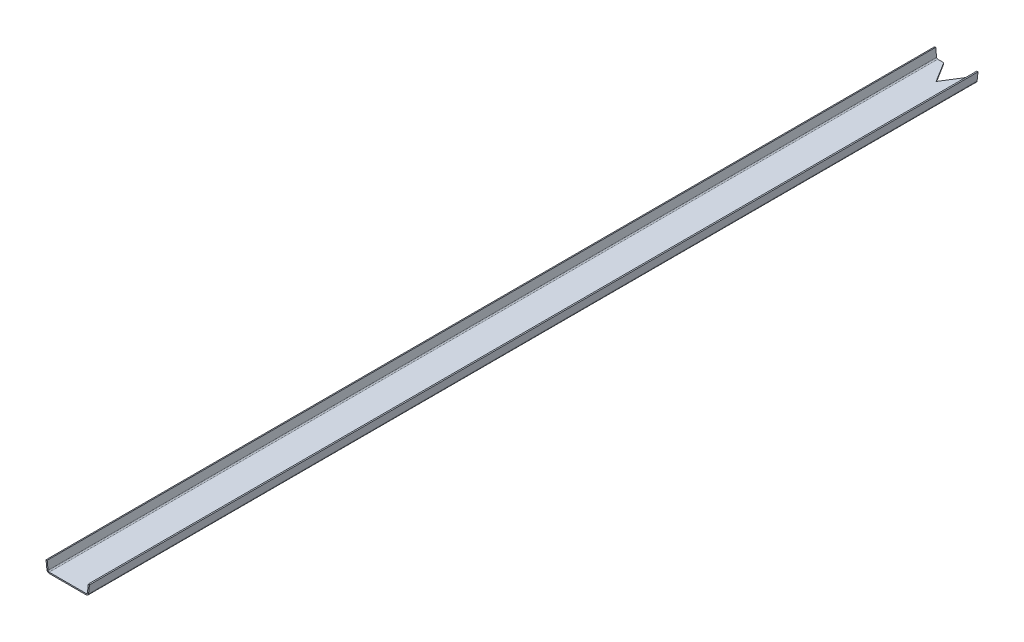
ISO-10303-21;
HEADER;
FILE_DESCRIPTION(('STEP AP214'),'2;1');
FILE_NAME('part.step','',(''),(''),'','','');
FILE_SCHEMA(('AUTOMOTIVE_DESIGN { 1 0 10303 214 1 1 1 1 }'));
ENDSEC;
DATA;
#1=APPLICATION_CONTEXT('core data for automotive mechanical design processes');
#2=APPLICATION_PROTOCOL_DEFINITION('international standard','automotive_design',2000,#1);
#3=PRODUCT_CONTEXT('',#1,'mechanical');
#4=PRODUCT('Part','Part','',(#3));
#5=PRODUCT_RELATED_PRODUCT_CATEGORY('part','',(#4));
#6=PRODUCT_DEFINITION_FORMATION('','',#4);
#7=PRODUCT_DEFINITION_CONTEXT('part definition',#1,'design');
#8=PRODUCT_DEFINITION('design','',#6,#7);
#9=PRODUCT_DEFINITION_SHAPE('','',#8);
#10=(LENGTH_UNIT() NAMED_UNIT(*) SI_UNIT(.MILLI.,.METRE.));
#11=(NAMED_UNIT(*) PLANE_ANGLE_UNIT() SI_UNIT($,.RADIAN.));
#12=(NAMED_UNIT(*) SI_UNIT($,.STERADIAN.) SOLID_ANGLE_UNIT());
#13=UNCERTAINTY_MEASURE_WITH_UNIT(LENGTH_MEASURE(1.E-05),#10,'distance_accuracy_value','');
#14=(GEOMETRIC_REPRESENTATION_CONTEXT(3) GLOBAL_UNCERTAINTY_ASSIGNED_CONTEXT((#13)) GLOBAL_UNIT_ASSIGNED_CONTEXT((#10,
#11,#12)) REPRESENTATION_CONTEXT('',''));
#15=CARTESIAN_POINT('',(0.,0.,0.));
#16=DIRECTION('',(0.,0.,1.));
#17=DIRECTION('',(1.,0.,0.));
#18=AXIS2_PLACEMENT_3D('',#15,#16,#17);
#19=CARTESIAN_POINT('',(13.9144750723848,-54.4541973925181,0.));
#20=DIRECTION('',(0.,0.,-1.));
#21=DIRECTION('',(-1.,0.,0.));
#22=AXIS2_PLACEMENT_3D('',#19,#20,#21);
#23=PLANE('',#22);
#24=DIRECTION('',(0.,1.,0.));
#25=VECTOR('',#24,1.);
#26=CARTESIAN_POINT('',(231.,-69.5970545353753,0.));
#27=LINE('',#26,#25);
#28=CARTESIAN_POINT('',(231.,-69.5970545353753,0.));
#29=VERTEX_POINT('',#28);
#30=CARTESIAN_POINT('',(231.,-61.5970545353752,0.));
#31=VERTEX_POINT('',#30);
#32=EDGE_CURVE('E555',#29,#31,#27,.T.);
#33=ORIENTED_EDGE('',*,*,#32,.T.);
#34=DIRECTION('',(1.,0.,0.));
#35=VECTOR('',#34,1.);
#36=CARTESIAN_POINT('',(7.50000000000001,-61.5970545353753,0.));
#37=LINE('',#36,#35);
#38=CARTESIAN_POINT('',(271.131575837858,-61.5970545353752,0.));
#39=VERTEX_POINT('',#38);
#40=EDGE_CURVE('E196',#31,#39,#37,.T.);
#41=ORIENTED_EDGE('',*,*,#40,.T.);
#42=DIRECTION('',(0.,-1.,0.));
#43=VECTOR('',#42,1.);
#44=CARTESIAN_POINT('',(271.131575837858,-61.5970545353752,0.));
#45=LINE('',#44,#43);
#46=CARTESIAN_POINT('',(271.131575837858,-69.5970545353752,0.));
#47=VERTEX_POINT('',#46);
#48=EDGE_CURVE('E242',#39,#47,#45,.T.);
#49=ORIENTED_EDGE('',*,*,#48,.T.);
#50=DIRECTION('',(1.,0.,0.));
#51=VECTOR('',#50,1.);
#52=CARTESIAN_POINT('',(7.50000000000001,-69.5970545353753,0.));
#53=LINE('',#52,#51);
#54=EDGE_CURVE('E213',#29,#47,#53,.T.);
#55=ORIENTED_EDGE('',*,*,#54,.F.);
#56=EDGE_LOOP('',(#33,#41,#49,#55));
#57=FACE_BOUND('',#56,.T.);
#58=ADVANCED_FACE('F37',(#57),#23,.T.);
#59=CARTESIAN_POINT('',(5.96052598262765,-55.3113402496609,5990.));
#60=DIRECTION('',(0.,0.,1.));
#61=DIRECTION('',(1.,0.,0.));
#62=AXIS2_PLACEMENT_3D('',#59,#60,#61);
#63=PLANE('',#62);
#64=DIRECTION('',(0.994243636219647,0.107142857142856,0.));
#65=VECTOR('',#64,1.);
#66=CARTESIAN_POINT('',(5.96052598262765,-55.3113402496609,5990.));
#67=LINE('',#66,#65);
#68=CARTESIAN_POINT('',(5.96052598262765,-55.3113402496609,5990.));
#69=VERTEX_POINT('',#68);
#70=CARTESIAN_POINT('',(13.9144750723848,-54.4541973925181,5990.));
#71=VERTEX_POINT('',#70);
#72=EDGE_CURVE('E11',#69,#71,#67,.T.);
#73=ORIENTED_EDGE('',*,*,#72,.F.);
#74=CARTESIAN_POINT('',(21.868424162142,-53.5970545353753,5990.));
#75=DIRECTION('',(0.,0.,-1.));
#76=DIRECTION('',(-1.,0.,0.));
#77=AXIS2_PLACEMENT_3D('',#74,#75,#76);
#78=CIRCLE('',#77,16.);
#79=CARTESIAN_POINT('',(21.868424162142,-69.5970545353753,5990.));
#80=VERTEX_POINT('',#79);
#81=EDGE_CURVE('E155',#69,#80,#78,.F.);
#82=ORIENTED_EDGE('',*,*,#81,.T.);
#83=DIRECTION('',(0.,-1.,0.));
#84=VECTOR('',#83,1.);
#85=CARTESIAN_POINT('',(21.868424162142,-61.5970545353753,5990.));
#86=LINE('',#85,#84);
#87=CARTESIAN_POINT('',(21.868424162142,-61.5970545353753,5990.));
#88=VERTEX_POINT('',#87);
#89=EDGE_CURVE('E45',#88,#80,#86,.T.);
#90=ORIENTED_EDGE('',*,*,#89,.F.);
#91=CARTESIAN_POINT('',(21.868424162142,-53.5970545353753,5990.));
#92=DIRECTION('',(0.,0.,1.));
#93=DIRECTION('',(1.,0.,0.));
#94=AXIS2_PLACEMENT_3D('',#91,#92,#93);
#95=CIRCLE('',#94,8.);
#96=EDGE_CURVE('E261',#71,#88,#95,.T.);
#97=ORIENTED_EDGE('',*,*,#96,.F.);
#98=EDGE_LOOP('',(#73,#82,#90,#97));
#99=FACE_BOUND('',#98,.T.);
#100=ADVANCED_FACE('F39',(#99),#63,.T.);
#101=CARTESIAN_POINT('',(21.868424162142,-61.5970545353753,5990.));
#102=DIRECTION('',(0.,0.,1.));
#103=DIRECTION('',(1.,0.,0.));
#104=AXIS2_PLACEMENT_3D('',#101,#102,#103);
#105=PLANE('',#104);
#106=DIRECTION('',(0.107142857142857,-0.994243636219647,0.));
#107=VECTOR('',#106,1.);
#108=CARTESIAN_POINT('',(0.,0.,5990.));
#109=LINE('',#108,#107);
#110=CARTESIAN_POINT('',(0.,0.,5990.));
#111=VERTEX_POINT('',#110);
#112=EDGE_CURVE('E160',#111,#69,#109,.T.);
#113=ORIENTED_EDGE('',*,*,#112,.T.);
#114=ORIENTED_EDGE('',*,*,#72,.T.);
#115=DIRECTION('',(0.107142857142857,-0.994243636219647,0.));
#116=VECTOR('',#115,1.);
#117=CARTESIAN_POINT('',(7.95394908975717,0.857142857142858,5990.));
#118=LINE('',#117,#116);
#119=CARTESIAN_POINT('',(7.95394908975717,0.857142857142858,5990.));
#120=VERTEX_POINT('',#119);
#121=EDGE_CURVE('E276',#120,#71,#118,.T.);
#122=ORIENTED_EDGE('',*,*,#121,.F.);
#123=DIRECTION('',(0.994243636219647,0.107142857142857,0.));
#124=VECTOR('',#123,1.);
#125=CARTESIAN_POINT('',(0.,0.,5990.));
#126=LINE('',#125,#124);
#127=EDGE_CURVE('E278',#111,#120,#126,.T.);
#128=ORIENTED_EDGE('',*,*,#127,.F.);
#129=EDGE_LOOP('',(#113,#114,#122,#128));
#130=FACE_BOUND('',#129,.T.);
#131=ADVANCED_FACE('F289',(#130),#105,.T.);
#132=CARTESIAN_POINT('',(21.868424162142,-69.5970545353753,0.));
#133=DIRECTION('',(0.,0.,-1.));
#134=DIRECTION('',(-1.,0.,0.));
#135=AXIS2_PLACEMENT_3D('',#132,#133,#134);
#136=PLANE('',#135);
#137=DIRECTION('',(0.,1.,0.));
#138=VECTOR('',#137,1.);
#139=CARTESIAN_POINT('',(21.868424162142,-69.5970545353753,0.));
#140=LINE('',#139,#138);
#141=CARTESIAN_POINT('',(21.868424162142,-69.5970545353753,0.));
#142=VERTEX_POINT('',#141);
#143=CARTESIAN_POINT('',(21.868424162142,-61.5970545353753,0.));
#144=VERTEX_POINT('',#143);
#145=EDGE_CURVE('E153',#142,#144,#140,.T.);
#146=ORIENTED_EDGE('',*,*,#145,.F.);
#147=CARTESIAN_POINT('',(21.868424162142,-53.5970545353753,0.));
#148=DIRECTION('',(0.,0.,-1.));
#149=DIRECTION('',(-1.,0.,0.));
#150=AXIS2_PLACEMENT_3D('',#147,#148,#149);
#151=CIRCLE('',#150,16.);
#152=CARTESIAN_POINT('',(5.96052598262765,-55.3113402496609,0.));
#153=VERTEX_POINT('',#152);
#154=EDGE_CURVE('E167',#153,#142,#151,.F.);
#155=ORIENTED_EDGE('',*,*,#154,.F.);
#156=DIRECTION('',(-0.994243636219647,-0.107142857142856,0.));
#157=VECTOR('',#156,1.);
#158=CARTESIAN_POINT('',(13.9144750723848,-54.4541973925181,0.));
#159=LINE('',#158,#157);
#160=CARTESIAN_POINT('',(13.9144750723848,-54.4541973925181,0.));
#161=VERTEX_POINT('',#160);
#162=EDGE_CURVE('E249',#161,#153,#159,.T.);
#163=ORIENTED_EDGE('',*,*,#162,.F.);
#164=CARTESIAN_POINT('',(21.868424162142,-53.5970545353753,0.));
#165=DIRECTION('',(0.,0.,1.));
#166=DIRECTION('',(1.,0.,0.));
#167=AXIS2_PLACEMENT_3D('',#164,#165,#166);
#168=CIRCLE('',#167,8.);
#169=EDGE_CURVE('E200',#161,#144,#168,.T.);
#170=ORIENTED_EDGE('',*,*,#169,.T.);
#171=EDGE_LOOP('',(#146,#155,#163,#170));
#172=FACE_BOUND('',#171,.T.);
#173=ADVANCED_FACE('F268',(#172),#136,.T.);
#174=DIRECTION('',(0.,1.,0.));
#175=VECTOR('',#174,1.);
#176=CARTESIAN_POINT('',(62.,-69.5970545353753,0.));
#177=LINE('',#176,#175);
#178=CARTESIAN_POINT('',(62.,-69.5970545353753,0.));
#179=VERTEX_POINT('',#178);
#180=CARTESIAN_POINT('',(62.,-61.5970545353753,0.));
#181=VERTEX_POINT('',#180);
#182=EDGE_CURVE('E552',#179,#181,#177,.T.);
#183=ORIENTED_EDGE('',*,*,#182,.F.);
#184=EDGE_CURVE('E214',#142,#179,#53,.T.);
#185=ORIENTED_EDGE('',*,*,#184,.F.);
#186=ORIENTED_EDGE('',*,*,#145,.T.);
#187=EDGE_CURVE('E197',#144,#181,#37,.T.);
#188=ORIENTED_EDGE('',*,*,#187,.T.);
#189=EDGE_LOOP('',(#183,#185,#186,#188));
#190=FACE_BOUND('',#189,.T.);
#191=ADVANCED_FACE('F253',(#190),#23,.T.);
#192=CARTESIAN_POINT('',(271.131575837858,-69.5970545353752,5990.));
#193=DIRECTION('',(0.,0.,1.));
#194=DIRECTION('',(1.,0.,0.));
#195=AXIS2_PLACEMENT_3D('',#192,#193,#194);
#196=PLANE('',#195);
#197=DIRECTION('',(0.,1.,0.));
#198=VECTOR('',#197,1.);
#199=CARTESIAN_POINT('',(271.131575837858,-69.5970545353752,5990.));
#200=LINE('',#199,#198);
#201=CARTESIAN_POINT('',(271.131575837858,-69.5970545353752,5990.));
#202=VERTEX_POINT('',#201);
#203=CARTESIAN_POINT('',(271.131575837858,-61.5970545353752,5990.));
#204=VERTEX_POINT('',#203);
#205=EDGE_CURVE('E247',#202,#204,#200,.T.);
#206=ORIENTED_EDGE('',*,*,#205,.F.);
#207=CARTESIAN_POINT('',(271.131575837858,-53.5970545353752,5990.));
#208=DIRECTION('',(0.,0.,-1.));
#209=DIRECTION('',(-1.,0.,0.));
#210=AXIS2_PLACEMENT_3D('',#207,#208,#209);
#211=CIRCLE('',#210,16.);
#212=CARTESIAN_POINT('',(287.039474017372,-55.3113402496609,5990.));
#213=VERTEX_POINT('',#212);
#214=EDGE_CURVE('E178',#202,#213,#211,.F.);
#215=ORIENTED_EDGE('',*,*,#214,.T.);
#216=DIRECTION('',(0.994243636219647,-0.107142857142858,0.));
#217=VECTOR('',#216,1.);
#218=CARTESIAN_POINT('',(279.085524927615,-54.4541973925181,5990.));
#219=LINE('',#218,#217);
#220=CARTESIAN_POINT('',(279.085524927615,-54.4541973925181,5990.));
#221=VERTEX_POINT('',#220);
#222=EDGE_CURVE('E61',#221,#213,#219,.T.);
#223=ORIENTED_EDGE('',*,*,#222,.F.);
#224=CARTESIAN_POINT('',(271.131575837858,-53.5970545353752,5990.));
#225=DIRECTION('',(0.,0.,1.));
#226=DIRECTION('',(1.,0.,0.));
#227=AXIS2_PLACEMENT_3D('',#224,#225,#226);
#228=CIRCLE('',#227,8.);
#229=EDGE_CURVE('E280',#204,#221,#228,.T.);
#230=ORIENTED_EDGE('',*,*,#229,.F.);
#231=EDGE_LOOP('',(#206,#215,#223,#230));
#232=FACE_BOUND('',#231,.T.);
#233=ADVANCED_FACE('F314',(#232),#196,.T.);
#234=CARTESIAN_POINT('',(279.085524927615,-54.4541973925181,5990.));
#235=DIRECTION('',(0.,0.,1.));
#236=DIRECTION('',(1.,0.,0.));
#237=AXIS2_PLACEMENT_3D('',#234,#235,#236);
#238=PLANE('',#237);
#239=DIRECTION('',(1.,0.,0.));
#240=VECTOR('',#239,1.);
#241=CARTESIAN_POINT('',(7.50000000000001,-69.5970545353753,5990.));
#242=LINE('',#241,#240);
#243=EDGE_CURVE('E145',#80,#202,#242,.T.);
#244=ORIENTED_EDGE('',*,*,#243,.T.);
#245=ORIENTED_EDGE('',*,*,#205,.T.);
#246=DIRECTION('',(1.,0.,0.));
#247=VECTOR('',#246,1.);
#248=CARTESIAN_POINT('',(7.50000000000001,-61.5970545353753,5990.));
#249=LINE('',#248,#247);
#250=EDGE_CURVE('E148',#88,#204,#249,.T.);
#251=ORIENTED_EDGE('',*,*,#250,.F.);
#252=ORIENTED_EDGE('',*,*,#89,.T.);
#253=EDGE_LOOP('',(#244,#245,#251,#252));
#254=FACE_BOUND('',#253,.T.);
#255=ADVANCED_FACE('F143',(#254),#238,.T.);
#256=CARTESIAN_POINT('',(287.039474017372,-55.3113402496609,0.));
#257=DIRECTION('',(0.,0.,-1.));
#258=DIRECTION('',(-1.,0.,0.));
#259=AXIS2_PLACEMENT_3D('',#256,#257,#258);
#260=PLANE('',#259);
#261=DIRECTION('',(-0.994243636219647,0.107142857142858,0.));
#262=VECTOR('',#261,1.);
#263=CARTESIAN_POINT('',(287.039474017372,-55.3113402496609,0.));
#264=LINE('',#263,#262);
#265=CARTESIAN_POINT('',(287.039474017372,-55.3113402496609,0.));
#266=VERTEX_POINT('',#265);
#267=CARTESIAN_POINT('',(279.085524927615,-54.4541973925181,0.));
#268=VERTEX_POINT('',#267);
#269=EDGE_CURVE('E107',#266,#268,#264,.T.);
#270=ORIENTED_EDGE('',*,*,#269,.F.);
#271=CARTESIAN_POINT('',(271.131575837858,-53.5970545353752,0.));
#272=DIRECTION('',(0.,0.,-1.));
#273=DIRECTION('',(-1.,0.,0.));
#274=AXIS2_PLACEMENT_3D('',#271,#272,#273);
#275=CIRCLE('',#274,16.);
#276=EDGE_CURVE('E216',#47,#266,#275,.F.);
#277=ORIENTED_EDGE('',*,*,#276,.F.);
#278=ORIENTED_EDGE('',*,*,#48,.F.);
#279=CARTESIAN_POINT('',(271.131575837858,-53.5970545353752,0.));
#280=DIRECTION('',(0.,0.,1.));
#281=DIRECTION('',(1.,0.,0.));
#282=AXIS2_PLACEMENT_3D('',#279,#280,#281);
#283=CIRCLE('',#282,8.);
#284=EDGE_CURVE('E194',#39,#268,#283,.T.);
#285=ORIENTED_EDGE('',*,*,#284,.T.);
#286=EDGE_LOOP('',(#270,#277,#278,#285));
#287=FACE_BOUND('',#286,.T.);
#288=ADVANCED_FACE('F370',(#287),#260,.T.);
#289=CARTESIAN_POINT('',(271.131575837858,-61.5970545353752,0.));
#290=DIRECTION('',(0.,0.,-1.));
#291=DIRECTION('',(-1.,0.,0.));
#292=AXIS2_PLACEMENT_3D('',#289,#290,#291);
#293=PLANE('',#292);
#294=DIRECTION('',(0.107142857142857,0.994243636219647,0.));
#295=VECTOR('',#294,1.);
#296=CARTESIAN_POINT('',(285.5,-69.5970545353752,0.));
#297=LINE('',#296,#295);
#298=CARTESIAN_POINT('',(293.,0.,0.));
#299=VERTEX_POINT('',#298);
#300=EDGE_CURVE('E184',#266,#299,#297,.T.);
#301=ORIENTED_EDGE('',*,*,#300,.F.);
#302=ORIENTED_EDGE('',*,*,#269,.T.);
#303=DIRECTION('',(0.107142857142857,0.994243636219647,0.));
#304=VECTOR('',#303,1.);
#305=CARTESIAN_POINT('',(277.546050910243,-68.7399116782324,0.));
#306=LINE('',#305,#304);
#307=CARTESIAN_POINT('',(285.046050910243,0.857142857142904,0.));
#308=VERTEX_POINT('',#307);
#309=EDGE_CURVE('E191',#268,#308,#306,.T.);
#310=ORIENTED_EDGE('',*,*,#309,.T.);
#311=DIRECTION('',(0.994243636219647,-0.107142857142859,0.));
#312=VECTOR('',#311,1.);
#313=CARTESIAN_POINT('',(285.046050910243,0.857142857142904,0.));
#314=LINE('',#313,#312);
#315=EDGE_CURVE('E187',#308,#299,#314,.T.);
#316=ORIENTED_EDGE('',*,*,#315,.T.);
#317=EDGE_LOOP('',(#301,#302,#310,#316));
#318=FACE_BOUND('',#317,.T.);
#319=ADVANCED_FACE('F380',(#318),#293,.T.);
#320=CARTESIAN_POINT('',(285.5,-69.5970545353752,5990.));
#321=DIRECTION('',(-0.994243636219647,0.107142857142857,0.));
#322=DIRECTION('',(-0.107142857142857,-0.994243636219647,0.));
#323=AXIS2_PLACEMENT_3D('',#320,#321,#322);
#324=PLANE('',#323);
#325=ORIENTED_EDGE('',*,*,#300,.T.);
#326=DIRECTION('',(0.,0.,-1.));
#327=VECTOR('',#326,1.);
#328=CARTESIAN_POINT('',(293.,0.,5990.));
#329=LINE('',#328,#327);
#330=CARTESIAN_POINT('',(293.,0.,5990.));
#331=VERTEX_POINT('',#330);
#332=EDGE_CURVE('E240',#331,#299,#329,.T.);
#333=ORIENTED_EDGE('',*,*,#332,.F.);
#334=DIRECTION('',(0.107142857142857,0.994243636219647,0.));
#335=VECTOR('',#334,1.);
#336=CARTESIAN_POINT('',(285.5,-69.5970545353752,5990.));
#337=LINE('',#336,#335);
#338=EDGE_CURVE('E113',#213,#331,#337,.T.);
#339=ORIENTED_EDGE('',*,*,#338,.F.);
#340=DIRECTION('',(0.,0.,-1.));
#341=VECTOR('',#340,1.);
#342=CARTESIAN_POINT('',(287.039474017372,-55.3113402496609,5990.));
#343=LINE('',#342,#341);
#344=EDGE_CURVE('E180',#213,#266,#343,.T.);
#345=ORIENTED_EDGE('',*,*,#344,.T.);
#346=EDGE_LOOP('',(#325,#333,#339,#345));
#347=FACE_BOUND('',#346,.T.);
#348=ADVANCED_FACE('F390',(#347),#324,.F.);
#349=CARTESIAN_POINT('',(285.046050910243,0.857142857142904,5990.));
#350=DIRECTION('',(0.107142857142859,0.994243636219647,0.));
#351=DIRECTION('',(-0.994243636219647,0.107142857142859,0.));
#352=AXIS2_PLACEMENT_3D('',#349,#350,#351);
#353=PLANE('',#352);
#354=ORIENTED_EDGE('',*,*,#315,.F.);
#355=DIRECTION('',(0.,0.,-1.));
#356=VECTOR('',#355,1.);
#357=CARTESIAN_POINT('',(285.046050910243,0.857142857142904,5990.));
#358=LINE('',#357,#356);
#359=CARTESIAN_POINT('',(285.046050910243,0.857142857142904,5990.));
#360=VERTEX_POINT('',#359);
#361=EDGE_CURVE('E238',#360,#308,#358,.T.);
#362=ORIENTED_EDGE('',*,*,#361,.F.);
#363=DIRECTION('',(0.994243636219647,-0.107142857142859,0.));
#364=VECTOR('',#363,1.);
#365=CARTESIAN_POINT('',(285.046050910243,0.857142857142904,5990.));
#366=LINE('',#365,#364);
#367=EDGE_CURVE('E564',#360,#331,#366,.T.);
#368=ORIENTED_EDGE('',*,*,#367,.T.);
#369=ORIENTED_EDGE('',*,*,#332,.T.);
#370=EDGE_LOOP('',(#354,#362,#368,#369));
#371=FACE_BOUND('',#370,.T.);
#372=ADVANCED_FACE('F401',(#371),#353,.T.);
#373=CARTESIAN_POINT('',(277.546050910243,-68.7399116782324,5990.));
#374=DIRECTION('',(-0.994243636219647,0.107142857142857,0.));
#375=DIRECTION('',(-0.107142857142857,-0.994243636219647,0.));
#376=AXIS2_PLACEMENT_3D('',#373,#374,#375);
#377=PLANE('',#376);
#378=ORIENTED_EDGE('',*,*,#309,.F.);
#379=DIRECTION('',(0.,0.,-1.));
#380=VECTOR('',#379,1.);
#381=CARTESIAN_POINT('',(279.085524927615,-54.4541973925181,5990.));
#382=LINE('',#381,#380);
#383=EDGE_CURVE('E235',#221,#268,#382,.T.);
#384=ORIENTED_EDGE('',*,*,#383,.F.);
#385=DIRECTION('',(0.107142857142857,0.994243636219647,0.));
#386=VECTOR('',#385,1.);
#387=CARTESIAN_POINT('',(277.546050910243,-68.7399116782324,5990.));
#388=LINE('',#387,#386);
#389=EDGE_CURVE('E567',#221,#360,#388,.T.);
#390=ORIENTED_EDGE('',*,*,#389,.T.);
#391=ORIENTED_EDGE('',*,*,#361,.T.);
#392=EDGE_LOOP('',(#378,#384,#390,#391));
#393=FACE_BOUND('',#392,.T.);
#394=ADVANCED_FACE('F412',(#393),#377,.T.);
#395=CARTESIAN_POINT('',(271.131575837858,-53.5970545353752,5990.));
#396=DIRECTION('',(0.,0.,-1.));
#397=DIRECTION('',(-1.,0.,0.));
#398=AXIS2_PLACEMENT_3D('',#395,#396,#397);
#399=CYLINDRICAL_SURFACE('',#398,8.);
#400=ORIENTED_EDGE('',*,*,#284,.F.);
#401=DIRECTION('',(0.,0.,-1.));
#402=VECTOR('',#401,1.);
#403=CARTESIAN_POINT('',(271.131575837858,-61.5970545353752,5990.));
#404=LINE('',#403,#402);
#405=EDGE_CURVE('E232',#204,#39,#404,.T.);
#406=ORIENTED_EDGE('',*,*,#405,.F.);
#407=ORIENTED_EDGE('',*,*,#229,.T.);
#408=ORIENTED_EDGE('',*,*,#383,.T.);
#409=EDGE_LOOP('',(#400,#406,#407,#408));
#410=FACE_BOUND('',#409,.T.);
#411=ADVANCED_FACE('F423',(#410),#399,.F.);
#412=CARTESIAN_POINT('',(7.50000000000001,-61.5970545353753,5990.));
#413=DIRECTION('',(0.,1.,0.));
#414=DIRECTION('',(-1.,0.,0.));
#415=AXIS2_PLACEMENT_3D('',#412,#413,#414);
#416=PLANE('',#415);
#417=DIRECTION('',(0.528125,0.,-0.849166641110566));
#418=VECTOR('',#417,1.);
#419=CARTESIAN_POINT('',(-2517.64986218793,-61.5970545353755,4419.52524698346));
#420=LINE('',#419,#418);
#421=CARTESIAN_POINT('',(146.5,-61.5970545353753,135.86666257769));
#422=VERTEX_POINT('',#421);
#423=EDGE_CURVE('E188',#422,#31,#420,.T.);
#424=ORIENTED_EDGE('',*,*,#423,.F.);
#425=DIRECTION('',(0.528125,0.,0.849166641110566));
#426=VECTOR('',#425,1.);
#427=CARTESIAN_POINT('',(2733.11120984418,-61.597054535375,4294.85166219391));
#428=LINE('',#427,#426);
#429=EDGE_CURVE('E267',#181,#422,#428,.T.);
#430=ORIENTED_EDGE('',*,*,#429,.F.);
#431=ORIENTED_EDGE('',*,*,#187,.F.);
#432=DIRECTION('',(0.,0.,-1.));
#433=VECTOR('',#432,1.);
#434=CARTESIAN_POINT('',(21.868424162142,-61.5970545353753,5990.));
#435=LINE('',#434,#433);
#436=EDGE_CURVE('E229',#88,#144,#435,.T.);
#437=ORIENTED_EDGE('',*,*,#436,.F.);
#438=ORIENTED_EDGE('',*,*,#250,.T.);
#439=ORIENTED_EDGE('',*,*,#405,.T.);
#440=ORIENTED_EDGE('',*,*,#40,.F.);
#441=EDGE_LOOP('',(#424,#430,#431,#437,#438,#439,#440));
#442=FACE_BOUND('',#441,.T.);
#443=ADVANCED_FACE('F265',(#442),#416,.T.);
#444=CARTESIAN_POINT('',(21.868424162142,-53.5970545353753,5990.));
#445=DIRECTION('',(0.,0.,-1.));
#446=DIRECTION('',(-1.,0.,0.));
#447=AXIS2_PLACEMENT_3D('',#444,#445,#446);
#448=CYLINDRICAL_SURFACE('',#447,8.);
#449=ORIENTED_EDGE('',*,*,#169,.F.);
#450=DIRECTION('',(0.,0.,-1.));
#451=VECTOR('',#450,1.);
#452=CARTESIAN_POINT('',(13.9144750723848,-54.4541973925181,5990.));
#453=LINE('',#452,#451);
#454=EDGE_CURVE('E226',#71,#161,#453,.T.);
#455=ORIENTED_EDGE('',*,*,#454,.F.);
#456=ORIENTED_EDGE('',*,*,#96,.T.);
#457=ORIENTED_EDGE('',*,*,#436,.T.);
#458=EDGE_LOOP('',(#449,#455,#456,#457));
#459=FACE_BOUND('',#458,.T.);
#460=ADVANCED_FACE('F259',(#459),#448,.F.);
#461=CARTESIAN_POINT('',(7.95394908975717,0.857142857142858,5990.));
#462=DIRECTION('',(0.994243636219647,0.107142857142857,0.));
#463=DIRECTION('',(-0.107142857142857,0.994243636219647,0.));
#464=AXIS2_PLACEMENT_3D('',#461,#462,#463);
#465=PLANE('',#464);
#466=DIRECTION('',(0.107142857142857,-0.994243636219647,0.));
#467=VECTOR('',#466,1.);
#468=CARTESIAN_POINT('',(7.95394908975717,0.857142857142858,0.));
#469=LINE('',#468,#467);
#470=CARTESIAN_POINT('',(7.95394908975717,0.857142857142858,0.));
#471=VERTEX_POINT('',#470);
#472=EDGE_CURVE('E203',#471,#161,#469,.T.);
#473=ORIENTED_EDGE('',*,*,#472,.F.);
#474=DIRECTION('',(0.,0.,-1.));
#475=VECTOR('',#474,1.);
#476=CARTESIAN_POINT('',(7.95394908975717,0.857142857142858,5990.));
#477=LINE('',#476,#475);
#478=EDGE_CURVE('E224',#120,#471,#477,.T.);
#479=ORIENTED_EDGE('',*,*,#478,.F.);
#480=ORIENTED_EDGE('',*,*,#121,.T.);
#481=ORIENTED_EDGE('',*,*,#454,.T.);
#482=EDGE_LOOP('',(#473,#479,#480,#481));
#483=FACE_BOUND('',#482,.T.);
#484=ADVANCED_FACE('F274',(#483),#465,.T.);
#485=CARTESIAN_POINT('',(0.,0.,5990.));
#486=DIRECTION('',(-0.107142857142857,0.994243636219647,0.));
#487=DIRECTION('',(-0.994243636219647,-0.107142857142857,0.));
#488=AXIS2_PLACEMENT_3D('',#485,#486,#487);
#489=PLANE('',#488);
#490=DIRECTION('',(0.994243636219647,0.107142857142857,0.));
#491=VECTOR('',#490,1.);
#492=CARTESIAN_POINT('',(0.,0.,0.));
#493=LINE('',#492,#491);
#494=CARTESIAN_POINT('',(0.,0.,0.));
#495=VERTEX_POINT('',#494);
#496=EDGE_CURVE('E206',#495,#471,#493,.T.);
#497=ORIENTED_EDGE('',*,*,#496,.F.);
#498=DIRECTION('',(0.,0.,-1.));
#499=VECTOR('',#498,1.);
#500=CARTESIAN_POINT('',(0.,0.,5990.));
#501=LINE('',#500,#499);
#502=EDGE_CURVE('E222',#111,#495,#501,.T.);
#503=ORIENTED_EDGE('',*,*,#502,.F.);
#504=ORIENTED_EDGE('',*,*,#127,.T.);
#505=ORIENTED_EDGE('',*,*,#478,.T.);
#506=EDGE_LOOP('',(#497,#503,#504,#505));
#507=FACE_BOUND('',#506,.T.);
#508=ADVANCED_FACE('F295',(#507),#489,.T.);
#509=CARTESIAN_POINT('',(0.,0.,5990.));
#510=DIRECTION('',(0.994243636219647,0.107142857142857,0.));
#511=DIRECTION('',(-0.107142857142857,0.994243636219647,0.));
#512=AXIS2_PLACEMENT_3D('',#509,#510,#511);
#513=PLANE('',#512);
#514=DIRECTION('',(0.107142857142857,-0.994243636219647,0.));
#515=VECTOR('',#514,1.);
#516=CARTESIAN_POINT('',(0.,0.,0.));
#517=LINE('',#516,#515);
#518=EDGE_CURVE('E209',#495,#153,#517,.T.);
#519=ORIENTED_EDGE('',*,*,#518,.T.);
#520=DIRECTION('',(0.,0.,-1.));
#521=VECTOR('',#520,1.);
#522=CARTESIAN_POINT('',(5.96052598262765,-55.3113402496609,5990.));
#523=LINE('',#522,#521);
#524=EDGE_CURVE('E171',#69,#153,#523,.T.);
#525=ORIENTED_EDGE('',*,*,#524,.F.);
#526=ORIENTED_EDGE('',*,*,#112,.F.);
#527=ORIENTED_EDGE('',*,*,#502,.T.);
#528=EDGE_LOOP('',(#519,#525,#526,#527));
#529=FACE_BOUND('',#528,.T.);
#530=ADVANCED_FACE('F291',(#529),#513,.F.);
#531=CARTESIAN_POINT('',(21.868424162142,-53.5970545353753,5990.));
#532=DIRECTION('',(0.,0.,-1.));
#533=DIRECTION('',(-1.,0.,0.));
#534=AXIS2_PLACEMENT_3D('',#531,#532,#533);
#535=CYLINDRICAL_SURFACE('',#534,16.);
#536=ORIENTED_EDGE('',*,*,#154,.T.);
#537=DIRECTION('',(0.,0.,-1.));
#538=VECTOR('',#537,1.);
#539=CARTESIAN_POINT('',(21.868424162142,-69.5970545353753,5990.));
#540=LINE('',#539,#538);
#541=EDGE_CURVE('E164',#80,#142,#540,.T.);
#542=ORIENTED_EDGE('',*,*,#541,.F.);
#543=ORIENTED_EDGE('',*,*,#81,.F.);
#544=ORIENTED_EDGE('',*,*,#524,.T.);
#545=EDGE_LOOP('',(#536,#542,#543,#544));
#546=FACE_BOUND('',#545,.T.);
#547=ADVANCED_FACE('F165',(#546),#535,.T.);
#548=CARTESIAN_POINT('',(7.50000000000001,-69.5970545353753,5990.));
#549=DIRECTION('',(0.,1.,0.));
#550=DIRECTION('',(-1.,0.,0.));
#551=AXIS2_PLACEMENT_3D('',#548,#549,#550);
#552=PLANE('',#551);
#553=DIRECTION('',(0.528125,0.,0.849166641110566));
#554=VECTOR('',#553,1.);
#555=CARTESIAN_POINT('',(62.,-69.5970545353753,0.));
#556=LINE('',#555,#554);
#557=CARTESIAN_POINT('',(146.499999999999,-69.5970545353752,135.86666257769));
#558=VERTEX_POINT('',#557);
#559=EDGE_CURVE('E583',#179,#558,#556,.T.);
#560=ORIENTED_EDGE('',*,*,#559,.T.);
#561=DIRECTION('',(0.528125,0.,-0.849166641110566));
#562=VECTOR('',#561,1.);
#563=CARTESIAN_POINT('',(146.5,-69.5970545353753,135.86666257769));
#564=LINE('',#563,#562);
#565=EDGE_CURVE('E52',#558,#29,#564,.T.);
#566=ORIENTED_EDGE('',*,*,#565,.T.);
#567=ORIENTED_EDGE('',*,*,#54,.T.);
#568=DIRECTION('',(0.,0.,-1.));
#569=VECTOR('',#568,1.);
#570=CARTESIAN_POINT('',(271.131575837858,-69.5970545353752,5990.));
#571=LINE('',#570,#569);
#572=EDGE_CURVE('E172',#202,#47,#571,.T.);
#573=ORIENTED_EDGE('',*,*,#572,.F.);
#574=ORIENTED_EDGE('',*,*,#243,.F.);
#575=ORIENTED_EDGE('',*,*,#541,.T.);
#576=ORIENTED_EDGE('',*,*,#184,.T.);
#577=EDGE_LOOP('',(#560,#566,#567,#573,#574,#575,#576));
#578=FACE_BOUND('',#577,.T.);
#579=ADVANCED_FACE('F175',(#578),#552,.F.);
#580=CARTESIAN_POINT('',(271.131575837858,-53.5970545353752,5990.));
#581=DIRECTION('',(0.,0.,-1.));
#582=DIRECTION('',(-1.,0.,0.));
#583=AXIS2_PLACEMENT_3D('',#580,#581,#582);
#584=CYLINDRICAL_SURFACE('',#583,16.);
#585=ORIENTED_EDGE('',*,*,#276,.T.);
#586=ORIENTED_EDGE('',*,*,#344,.F.);
#587=ORIENTED_EDGE('',*,*,#214,.F.);
#588=ORIENTED_EDGE('',*,*,#572,.T.);
#589=EDGE_LOOP('',(#585,#586,#587,#588));
#590=FACE_BOUND('',#589,.T.);
#591=ADVANCED_FACE('F489',(#590),#584,.T.);
#592=CARTESIAN_POINT('',(271.131575837858,-53.5970545353752,5990.));
#593=DIRECTION('',(0.,0.,1.));
#594=DIRECTION('',(1.,0.,0.));
#595=AXIS2_PLACEMENT_3D('',#592,#593,#594);
#596=PLANE('',#595);
#597=ORIENTED_EDGE('',*,*,#338,.T.);
#598=ORIENTED_EDGE('',*,*,#367,.F.);
#599=ORIENTED_EDGE('',*,*,#389,.F.);
#600=ORIENTED_EDGE('',*,*,#222,.T.);
#601=EDGE_LOOP('',(#597,#598,#599,#600));
#602=FACE_BOUND('',#601,.T.);
#603=ADVANCED_FACE('F499',(#602),#596,.T.);
#604=CARTESIAN_POINT('',(271.131575837858,-53.5970545353752,0.));
#605=DIRECTION('',(0.,0.,1.));
#606=DIRECTION('',(1.,0.,0.));
#607=AXIS2_PLACEMENT_3D('',#604,#605,#606);
#608=PLANE('',#607);
#609=ORIENTED_EDGE('',*,*,#472,.T.);
#610=ORIENTED_EDGE('',*,*,#162,.T.);
#611=ORIENTED_EDGE('',*,*,#518,.F.);
#612=ORIENTED_EDGE('',*,*,#496,.T.);
#613=EDGE_LOOP('',(#609,#610,#611,#612));
#614=FACE_BOUND('',#613,.T.);
#615=ADVANCED_FACE('F293',(#614),#608,.F.);
#616=CARTESIAN_POINT('',(146.5,-69.5970545353753,135.86666257769));
#617=DIRECTION('',(0.849166641110566,0.,0.528125));
#618=DIRECTION('',(0.528125,0.,-0.849166641110566));
#619=AXIS2_PLACEMENT_3D('',#616,#617,#618);
#620=PLANE('',#619);
#621=ORIENTED_EDGE('',*,*,#423,.T.);
#622=ORIENTED_EDGE('',*,*,#32,.F.);
#623=ORIENTED_EDGE('',*,*,#565,.F.);
#624=DIRECTION('',(0.,1.,0.));
#625=VECTOR('',#624,1.);
#626=CARTESIAN_POINT('',(146.5,-69.5970545353753,135.86666257769));
#627=LINE('',#626,#625);
#628=EDGE_CURVE('E551',#558,#422,#627,.T.);
#629=ORIENTED_EDGE('',*,*,#628,.T.);
#630=EDGE_LOOP('',(#621,#622,#623,#629));
#631=FACE_BOUND('',#630,.T.);
#632=ADVANCED_FACE('F518',(#631),#620,.F.);
#633=CARTESIAN_POINT('',(62.,-69.5970545353753,0.));
#634=DIRECTION('',(-0.849166641110566,0.,0.528125));
#635=DIRECTION('',(0.528125,0.,0.849166641110566));
#636=AXIS2_PLACEMENT_3D('',#633,#634,#635);
#637=PLANE('',#636);
#638=ORIENTED_EDGE('',*,*,#429,.T.);
#639=ORIENTED_EDGE('',*,*,#628,.F.);
#640=ORIENTED_EDGE('',*,*,#559,.F.);
#641=ORIENTED_EDGE('',*,*,#182,.T.);
#642=EDGE_LOOP('',(#638,#639,#640,#641));
#643=FACE_BOUND('',#642,.T.);
#644=ADVANCED_FACE('F530',(#643),#637,.F.);
#645=CLOSED_SHELL('',(#58,#100,#131,#173,#191,#233,#255,#288,#319,#348,#372,#394,#411,#443,#460,
#484,#508,#530,#547,#579,#591,#603,#615,#632,#644));
#646=MANIFOLD_SOLID_BREP('B2',#645);
#647=ADVANCED_BREP_SHAPE_REPRESENTATION('',(#18,#646),#14);
#648=SHAPE_DEFINITION_REPRESENTATION(#9,#647);
ENDSEC;
END-ISO-10303-21;
